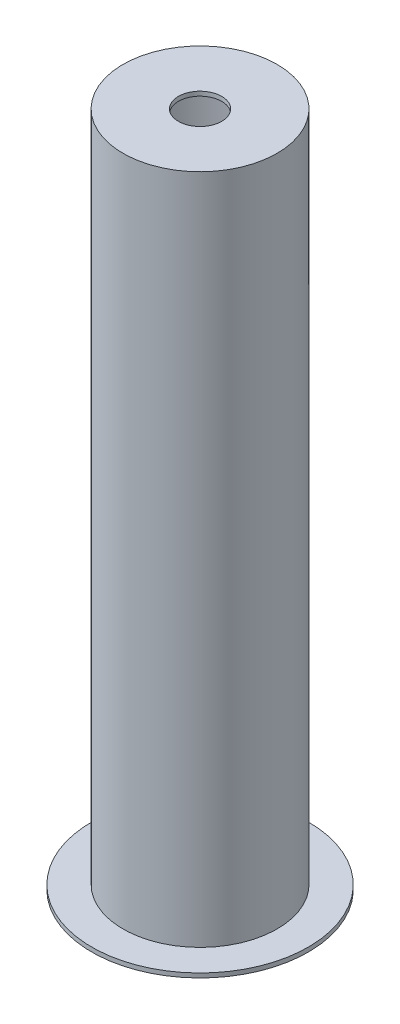
ISO-10303-21;
HEADER;
FILE_DESCRIPTION(('STEP AP214'),'2;1');
FILE_NAME('part.step','',(''),(''),'','','');
FILE_SCHEMA(('AUTOMOTIVE_DESIGN { 1 0 10303 214 1 1 1 1 }'));
ENDSEC;
DATA;
#1=APPLICATION_CONTEXT('core data for automotive mechanical design processes');
#2=APPLICATION_PROTOCOL_DEFINITION('international standard','automotive_design',2000,#1);
#3=PRODUCT_CONTEXT('',#1,'mechanical');
#4=PRODUCT('Part','Part','',(#3));
#5=PRODUCT_RELATED_PRODUCT_CATEGORY('part','',(#4));
#6=PRODUCT_DEFINITION_FORMATION('','',#4);
#7=PRODUCT_DEFINITION_CONTEXT('part definition',#1,'design');
#8=PRODUCT_DEFINITION('design','',#6,#7);
#9=PRODUCT_DEFINITION_SHAPE('','',#8);
#10=(LENGTH_UNIT() NAMED_UNIT(*) SI_UNIT(.MILLI.,.METRE.));
#11=(NAMED_UNIT(*) PLANE_ANGLE_UNIT() SI_UNIT($,.RADIAN.));
#12=(NAMED_UNIT(*) SI_UNIT($,.STERADIAN.) SOLID_ANGLE_UNIT());
#13=UNCERTAINTY_MEASURE_WITH_UNIT(LENGTH_MEASURE(1.E-05),#10,'distance_accuracy_value','');
#14=(GEOMETRIC_REPRESENTATION_CONTEXT(3) GLOBAL_UNCERTAINTY_ASSIGNED_CONTEXT((#13)) GLOBAL_UNIT_ASSIGNED_CONTEXT((#10,
#11,#12)) REPRESENTATION_CONTEXT('',''));
#15=CARTESIAN_POINT('',(0.,0.,0.));
#16=DIRECTION('',(0.,0.,1.));
#17=DIRECTION('',(1.,0.,0.));
#18=AXIS2_PLACEMENT_3D('',#15,#16,#17);
#19=CARTESIAN_POINT('',(0.,0.,0.));
#20=DIRECTION('',(0.,-1.,0.));
#21=DIRECTION('',(0.,0.,-1.));
#22=AXIS2_PLACEMENT_3D('',#19,#20,#21);
#23=CYLINDRICAL_SURFACE('',#22,50.);
#24=CARTESIAN_POINT('',(0.,1550.,0.));
#25=DIRECTION('',(0.,-1.,0.));
#26=DIRECTION('',(0.,0.,-1.));
#27=AXIS2_PLACEMENT_3D('',#24,#25,#26);
#28=CIRCLE('',#27,50.);
#29=CARTESIAN_POINT('',(0.,1550.,-50.));
#30=VERTEX_POINT('',#29);
#31=EDGE_CURVE('E78',#30,#30,#28,.T.);
#32=ORIENTED_EDGE('',*,*,#31,.T.);
#33=EDGE_LOOP('',(#32));
#34=FACE_BOUND('',#33,.T.);
#35=CARTESIAN_POINT('',(0.,1560.,0.));
#36=DIRECTION('',(0.,-1.,0.));
#37=DIRECTION('',(0.,0.,-1.));
#38=AXIS2_PLACEMENT_3D('',#35,#36,#37);
#39=CIRCLE('',#38,50.);
#40=CARTESIAN_POINT('',(0.,1560.,-50.));
#41=VERTEX_POINT('',#40);
#42=EDGE_CURVE('E12',#41,#41,#39,.T.);
#43=ORIENTED_EDGE('',*,*,#42,.F.);
#44=EDGE_LOOP('',(#43));
#45=FACE_BOUND('',#44,.T.);
#46=ADVANCED_FACE('F44',(#34,#45),#23,.F.);
#47=CARTESIAN_POINT('',(50.,1560.,0.));
#48=DIRECTION('',(0.,1.,0.));
#49=DIRECTION('',(0.,0.,1.));
#50=AXIS2_PLACEMENT_3D('',#47,#48,#49);
#51=PLANE('',#50);
#52=ORIENTED_EDGE('',*,*,#42,.T.);
#53=EDGE_LOOP('',(#52));
#54=FACE_BOUND('',#53,.T.);
#55=CARTESIAN_POINT('',(0.,1560.,0.));
#56=DIRECTION('',(0.,-1.,0.));
#57=DIRECTION('',(0.,0.,-1.));
#58=AXIS2_PLACEMENT_3D('',#55,#56,#57);
#59=CIRCLE('',#58,177.8);
#60=CARTESIAN_POINT('',(0.,1560.,-177.8));
#61=VERTEX_POINT('',#60);
#62=EDGE_CURVE('E50',#61,#61,#59,.T.);
#63=ORIENTED_EDGE('',*,*,#62,.F.);
#64=EDGE_LOOP('',(#63));
#65=FACE_BOUND('',#64,.T.);
#66=ADVANCED_FACE('F96',(#54,#65),#51,.T.);
#67=CARTESIAN_POINT('',(0.,0.,0.));
#68=DIRECTION('',(0.,-1.,0.));
#69=DIRECTION('',(0.,0.,-1.));
#70=AXIS2_PLACEMENT_3D('',#67,#68,#69);
#71=CYLINDRICAL_SURFACE('',#70,177.8);
#72=ORIENTED_EDGE('',*,*,#62,.T.);
#73=EDGE_LOOP('',(#72));
#74=FACE_BOUND('',#73,.T.);
#75=CARTESIAN_POINT('',(0.,10.,0.));
#76=DIRECTION('',(0.,-1.,0.));
#77=DIRECTION('',(0.,0.,-1.));
#78=AXIS2_PLACEMENT_3D('',#75,#76,#77);
#79=CIRCLE('',#78,177.8);
#80=CARTESIAN_POINT('',(0.,10.,-177.8));
#81=VERTEX_POINT('',#80);
#82=EDGE_CURVE('E54',#81,#81,#79,.T.);
#83=ORIENTED_EDGE('',*,*,#82,.F.);
#84=EDGE_LOOP('',(#83));
#85=FACE_BOUND('',#84,.T.);
#86=ADVANCED_FACE('F100',(#74,#85),#71,.T.);
#87=CARTESIAN_POINT('',(177.8,10.,0.));
#88=DIRECTION('',(0.,1.,0.));
#89=DIRECTION('',(0.,0.,1.));
#90=AXIS2_PLACEMENT_3D('',#87,#88,#89);
#91=PLANE('',#90);
#92=ORIENTED_EDGE('',*,*,#82,.T.);
#93=EDGE_LOOP('',(#92));
#94=FACE_BOUND('',#93,.T.);
#95=CARTESIAN_POINT('',(0.,10.,0.));
#96=DIRECTION('',(0.,-1.,0.));
#97=DIRECTION('',(0.,0.,-1.));
#98=AXIS2_PLACEMENT_3D('',#95,#96,#97);
#99=CIRCLE('',#98,250.);
#100=CARTESIAN_POINT('',(0.,10.,-250.));
#101=VERTEX_POINT('',#100);
#102=EDGE_CURVE('E58',#101,#101,#99,.T.);
#103=ORIENTED_EDGE('',*,*,#102,.F.);
#104=EDGE_LOOP('',(#103));
#105=FACE_BOUND('',#104,.T.);
#106=ADVANCED_FACE('F104',(#94,#105),#91,.T.);
#107=CARTESIAN_POINT('',(0.,0.,0.));
#108=DIRECTION('',(0.,-1.,0.));
#109=DIRECTION('',(0.,0.,-1.));
#110=AXIS2_PLACEMENT_3D('',#107,#108,#109);
#111=CYLINDRICAL_SURFACE('',#110,250.);
#112=ORIENTED_EDGE('',*,*,#102,.T.);
#113=EDGE_LOOP('',(#112));
#114=FACE_BOUND('',#113,.T.);
#115=CARTESIAN_POINT('',(0.,0.,0.));
#116=DIRECTION('',(0.,-1.,0.));
#117=DIRECTION('',(0.,0.,-1.));
#118=AXIS2_PLACEMENT_3D('',#115,#116,#117);
#119=CIRCLE('',#118,250.);
#120=CARTESIAN_POINT('',(0.,0.,-250.));
#121=VERTEX_POINT('',#120);
#122=EDGE_CURVE('E63',#121,#121,#119,.T.);
#123=ORIENTED_EDGE('',*,*,#122,.F.);
#124=EDGE_LOOP('',(#123));
#125=FACE_BOUND('',#124,.T.);
#126=ADVANCED_FACE('F110',(#114,#125),#111,.T.);
#127=CARTESIAN_POINT('',(170.,0.,0.));
#128=DIRECTION('',(0.,-1.,0.));
#129=DIRECTION('',(0.,0.,-1.));
#130=AXIS2_PLACEMENT_3D('',#127,#128,#129);
#131=PLANE('',#130);
#132=ORIENTED_EDGE('',*,*,#122,.T.);
#133=EDGE_LOOP('',(#132));
#134=FACE_BOUND('',#133,.T.);
#135=CARTESIAN_POINT('',(0.,0.,0.));
#136=DIRECTION('',(0.,-1.,0.));
#137=DIRECTION('',(0.,0.,-1.));
#138=AXIS2_PLACEMENT_3D('',#135,#136,#137);
#139=CIRCLE('',#138,170.);
#140=CARTESIAN_POINT('',(0.,0.,-170.));
#141=VERTEX_POINT('',#140);
#142=EDGE_CURVE('E66',#141,#141,#139,.T.);
#143=ORIENTED_EDGE('',*,*,#142,.F.);
#144=EDGE_LOOP('',(#143));
#145=FACE_BOUND('',#144,.T.);
#146=ADVANCED_FACE('F114',(#134,#145),#131,.T.);
#147=CARTESIAN_POINT('',(0.,0.,0.));
#148=DIRECTION('',(0.,-1.,0.));
#149=DIRECTION('',(0.,0.,-1.));
#150=AXIS2_PLACEMENT_3D('',#147,#148,#149);
#151=CYLINDRICAL_SURFACE('',#150,170.);
#152=ORIENTED_EDGE('',*,*,#142,.T.);
#153=EDGE_LOOP('',(#152));
#154=FACE_BOUND('',#153,.T.);
#155=CARTESIAN_POINT('',(0.,10.,0.));
#156=DIRECTION('',(0.,-1.,0.));
#157=DIRECTION('',(0.,0.,-1.));
#158=AXIS2_PLACEMENT_3D('',#155,#156,#157);
#159=CIRCLE('',#158,170.);
#160=CARTESIAN_POINT('',(0.,10.,-170.));
#161=VERTEX_POINT('',#160);
#162=EDGE_CURVE('E69',#161,#161,#159,.T.);
#163=ORIENTED_EDGE('',*,*,#162,.F.);
#164=EDGE_LOOP('',(#163));
#165=FACE_BOUND('',#164,.T.);
#166=ADVANCED_FACE('F118',(#154,#165),#151,.F.);
#167=CARTESIAN_POINT('',(173.02,10.,0.));
#168=DIRECTION('',(0.,1.,0.));
#169=DIRECTION('',(0.,0.,1.));
#170=AXIS2_PLACEMENT_3D('',#167,#168,#169);
#171=PLANE('',#170);
#172=ORIENTED_EDGE('',*,*,#162,.T.);
#173=EDGE_LOOP('',(#172));
#174=FACE_BOUND('',#173,.T.);
#175=CARTESIAN_POINT('',(0.,10.,0.));
#176=DIRECTION('',(0.,-1.,0.));
#177=DIRECTION('',(0.,0.,-1.));
#178=AXIS2_PLACEMENT_3D('',#175,#176,#177);
#179=CIRCLE('',#178,173.02);
#180=CARTESIAN_POINT('',(0.,10.,-173.02));
#181=VERTEX_POINT('',#180);
#182=EDGE_CURVE('E72',#181,#181,#179,.T.);
#183=ORIENTED_EDGE('',*,*,#182,.F.);
#184=EDGE_LOOP('',(#183));
#185=FACE_BOUND('',#184,.T.);
#186=ADVANCED_FACE('F92',(#174,#185),#171,.T.);
#187=CARTESIAN_POINT('',(0.,0.,0.));
#188=DIRECTION('',(0.,-1.,0.));
#189=DIRECTION('',(0.,0.,-1.));
#190=AXIS2_PLACEMENT_3D('',#187,#188,#189);
#191=CYLINDRICAL_SURFACE('',#190,173.02);
#192=ORIENTED_EDGE('',*,*,#182,.T.);
#193=EDGE_LOOP('',(#192));
#194=FACE_BOUND('',#193,.T.);
#195=CARTESIAN_POINT('',(0.,1550.,0.));
#196=DIRECTION('',(0.,-1.,0.));
#197=DIRECTION('',(0.,0.,-1.));
#198=AXIS2_PLACEMENT_3D('',#195,#196,#197);
#199=CIRCLE('',#198,173.02);
#200=CARTESIAN_POINT('',(0.,1550.,-173.02));
#201=VERTEX_POINT('',#200);
#202=EDGE_CURVE('E75',#201,#201,#199,.T.);
#203=ORIENTED_EDGE('',*,*,#202,.F.);
#204=EDGE_LOOP('',(#203));
#205=FACE_BOUND('',#204,.T.);
#206=ADVANCED_FACE('F86',(#194,#205),#191,.F.);
#207=CARTESIAN_POINT('',(173.02,1550.,0.));
#208=DIRECTION('',(0.,-1.,0.));
#209=DIRECTION('',(0.,0.,-1.));
#210=AXIS2_PLACEMENT_3D('',#207,#208,#209);
#211=PLANE('',#210);
#212=ORIENTED_EDGE('',*,*,#202,.T.);
#213=EDGE_LOOP('',(#212));
#214=FACE_BOUND('',#213,.T.);
#215=ORIENTED_EDGE('',*,*,#31,.F.);
#216=EDGE_LOOP('',(#215));
#217=FACE_BOUND('',#216,.T.);
#218=ADVANCED_FACE('F84',(#214,#217),#211,.T.);
#219=CLOSED_SHELL('',(#46,#66,#86,#106,#126,#146,#166,#186,#206,#218));
#220=MANIFOLD_SOLID_BREP('B2',#219);
#221=ADVANCED_BREP_SHAPE_REPRESENTATION('',(#18,#220),#14);
#222=SHAPE_DEFINITION_REPRESENTATION(#9,#221);
ENDSEC;
END-ISO-10303-21;
